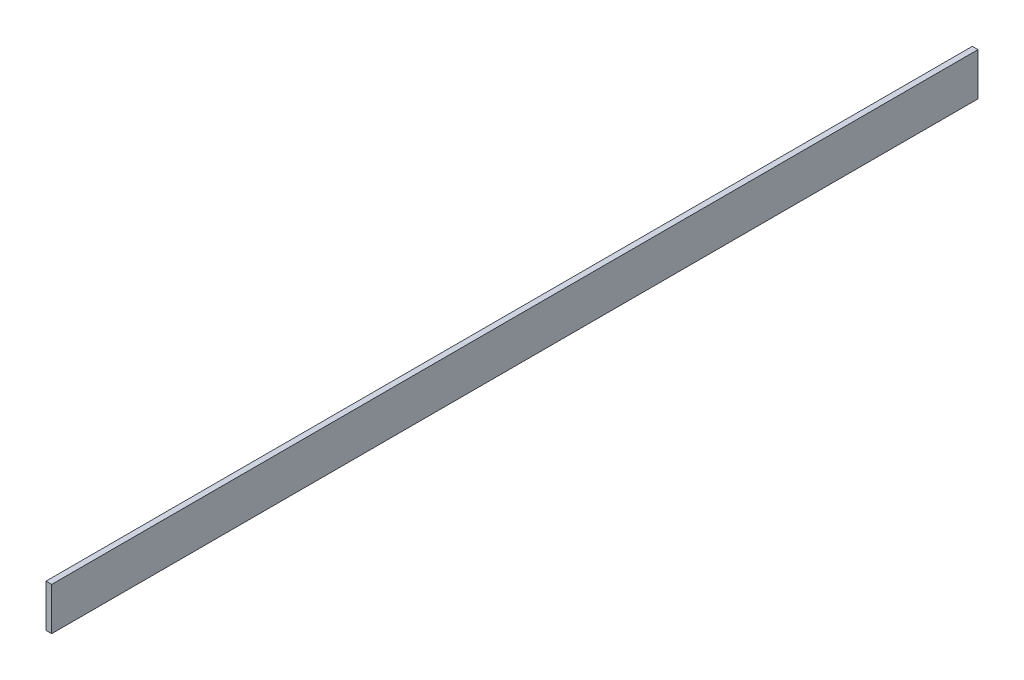
ISO-10303-21;
HEADER;
FILE_DESCRIPTION(('STEP AP214'),'2;1');
FILE_NAME('part.step','',(''),(''),'','','');
FILE_SCHEMA(('AUTOMOTIVE_DESIGN { 1 0 10303 214 1 1 1 1 }'));
ENDSEC;
DATA;
#1=APPLICATION_CONTEXT('core data for automotive mechanical design processes');
#2=APPLICATION_PROTOCOL_DEFINITION('international standard','automotive_design',2000,#1);
#3=PRODUCT_CONTEXT('',#1,'mechanical');
#4=PRODUCT('Part','Part','',(#3));
#5=PRODUCT_RELATED_PRODUCT_CATEGORY('part','',(#4));
#6=PRODUCT_DEFINITION_FORMATION('','',#4);
#7=PRODUCT_DEFINITION_CONTEXT('part definition',#1,'design');
#8=PRODUCT_DEFINITION('design','',#6,#7);
#9=PRODUCT_DEFINITION_SHAPE('','',#8);
#10=(LENGTH_UNIT() NAMED_UNIT(*) SI_UNIT(.MILLI.,.METRE.));
#11=(NAMED_UNIT(*) PLANE_ANGLE_UNIT() SI_UNIT($,.RADIAN.));
#12=(NAMED_UNIT(*) SI_UNIT($,.STERADIAN.) SOLID_ANGLE_UNIT());
#13=UNCERTAINTY_MEASURE_WITH_UNIT(LENGTH_MEASURE(1.E-05),#10,'distance_accuracy_value','');
#14=(GEOMETRIC_REPRESENTATION_CONTEXT(3) GLOBAL_UNCERTAINTY_ASSIGNED_CONTEXT((#13)) GLOBAL_UNIT_ASSIGNED_CONTEXT((#10,
#11,#12)) REPRESENTATION_CONTEXT('',''));
#15=CARTESIAN_POINT('',(0.,0.,0.));
#16=DIRECTION('',(0.,0.,1.));
#17=DIRECTION('',(1.,0.,0.));
#18=AXIS2_PLACEMENT_3D('',#15,#16,#17);
#19=CARTESIAN_POINT('',(-40.7498114749963,116.508082328953,-38.));
#20=DIRECTION('',(0.,-1.,0.));
#21=DIRECTION('',(1.,0.,0.));
#22=AXIS2_PLACEMENT_3D('',#19,#20,#21);
#23=PLANE('',#22);
#24=DIRECTION('',(0.,0.,-1.));
#25=VECTOR('',#24,1.);
#26=CARTESIAN_POINT('',(-36.7498114749963,116.508082328953,-38.));
#27=LINE('',#26,#25);
#28=CARTESIAN_POINT('',(-36.7498114749963,116.508082328953,613.));
#29=VERTEX_POINT('',#28);
#30=CARTESIAN_POINT('',(-36.7498114749963,116.508082328953,-38.));
#31=VERTEX_POINT('',#30);
#32=EDGE_CURVE('E97',#29,#31,#27,.T.);
#33=ORIENTED_EDGE('',*,*,#32,.T.);
#34=DIRECTION('',(1.,0.,0.));
#35=VECTOR('',#34,1.);
#36=CARTESIAN_POINT('',(-40.7498114749963,116.508082328953,-38.));
#37=LINE('',#36,#35);
#38=CARTESIAN_POINT('',(-40.7498114749963,116.508082328953,-38.));
#39=VERTEX_POINT('',#38);
#40=EDGE_CURVE('E11',#39,#31,#37,.T.);
#41=ORIENTED_EDGE('',*,*,#40,.F.);
#42=DIRECTION('',(0.,0.,-1.));
#43=VECTOR('',#42,1.);
#44=CARTESIAN_POINT('',(-40.7498114749963,116.508082328953,-38.));
#45=LINE('',#44,#43);
#46=CARTESIAN_POINT('',(-40.7498114749963,116.508082328953,613.));
#47=VERTEX_POINT('',#46);
#48=EDGE_CURVE('E85',#47,#39,#45,.T.);
#49=ORIENTED_EDGE('',*,*,#48,.F.);
#50=DIRECTION('',(1.,0.,0.));
#51=VECTOR('',#50,1.);
#52=CARTESIAN_POINT('',(-40.7498114749963,116.508082328953,613.));
#53=LINE('',#52,#51);
#54=EDGE_CURVE('E93',#47,#29,#53,.T.);
#55=ORIENTED_EDGE('',*,*,#54,.T.);
#56=EDGE_LOOP('',(#33,#41,#49,#55));
#57=FACE_BOUND('',#56,.T.);
#58=ADVANCED_FACE('F34',(#57),#23,.F.);
#59=CARTESIAN_POINT('',(-40.7498114749963,116.508082328953,-38.));
#60=DIRECTION('',(0.,0.,1.));
#61=DIRECTION('',(0.,-1.,0.));
#62=AXIS2_PLACEMENT_3D('',#59,#60,#61);
#63=PLANE('',#62);
#64=DIRECTION('',(0.,-1.,0.));
#65=VECTOR('',#64,1.);
#66=CARTESIAN_POINT('',(-36.7498114749963,116.508082328953,-38.));
#67=LINE('',#66,#65);
#68=CARTESIAN_POINT('',(-36.7498114749963,86.5080823289529,-38.));
#69=VERTEX_POINT('',#68);
#70=EDGE_CURVE('E89',#31,#69,#67,.T.);
#71=ORIENTED_EDGE('',*,*,#70,.T.);
#72=DIRECTION('',(1.,0.,0.));
#73=VECTOR('',#72,1.);
#74=CARTESIAN_POINT('',(-40.7498114749963,86.5080823289529,-38.));
#75=LINE('',#74,#73);
#76=CARTESIAN_POINT('',(-40.7498114749963,86.5080823289529,-38.));
#77=VERTEX_POINT('',#76);
#78=EDGE_CURVE('E42',#77,#69,#75,.T.);
#79=ORIENTED_EDGE('',*,*,#78,.F.);
#80=DIRECTION('',(0.,-1.,0.));
#81=VECTOR('',#80,1.);
#82=CARTESIAN_POINT('',(-40.7498114749963,116.508082328953,-38.));
#83=LINE('',#82,#81);
#84=EDGE_CURVE('E80',#39,#77,#83,.T.);
#85=ORIENTED_EDGE('',*,*,#84,.F.);
#86=ORIENTED_EDGE('',*,*,#40,.T.);
#87=EDGE_LOOP('',(#71,#79,#85,#86));
#88=FACE_BOUND('',#87,.T.);
#89=ADVANCED_FACE('F88',(#88),#63,.F.);
#90=CARTESIAN_POINT('',(-40.7498114749963,86.5080823289529,-38.));
#91=DIRECTION('',(0.,1.,0.));
#92=DIRECTION('',(-1.,0.,0.));
#93=AXIS2_PLACEMENT_3D('',#90,#91,#92);
#94=PLANE('',#93);
#95=DIRECTION('',(0.,0.,1.));
#96=VECTOR('',#95,1.);
#97=CARTESIAN_POINT('',(-36.7498114749963,86.5080823289529,-38.));
#98=LINE('',#97,#96);
#99=CARTESIAN_POINT('',(-36.7498114749963,86.5080823289529,613.));
#100=VERTEX_POINT('',#99);
#101=EDGE_CURVE('E67',#69,#100,#98,.T.);
#102=ORIENTED_EDGE('',*,*,#101,.T.);
#103=DIRECTION('',(1.,0.,0.));
#104=VECTOR('',#103,1.);
#105=CARTESIAN_POINT('',(-40.7498114749963,86.5080823289529,613.));
#106=LINE('',#105,#104);
#107=CARTESIAN_POINT('',(-40.7498114749963,86.5080823289529,613.));
#108=VERTEX_POINT('',#107);
#109=EDGE_CURVE('E90',#108,#100,#106,.T.);
#110=ORIENTED_EDGE('',*,*,#109,.F.);
#111=DIRECTION('',(0.,0.,1.));
#112=VECTOR('',#111,1.);
#113=CARTESIAN_POINT('',(-40.7498114749963,86.5080823289529,-38.));
#114=LINE('',#113,#112);
#115=EDGE_CURVE('E83',#77,#108,#114,.T.);
#116=ORIENTED_EDGE('',*,*,#115,.F.);
#117=ORIENTED_EDGE('',*,*,#78,.T.);
#118=EDGE_LOOP('',(#102,#110,#116,#117));
#119=FACE_BOUND('',#118,.T.);
#120=ADVANCED_FACE('F91',(#119),#94,.F.);
#121=CARTESIAN_POINT('',(-40.7498114749963,116.508082328953,613.));
#122=DIRECTION('',(0.,0.,-1.));
#123=DIRECTION('',(-1.,0.,0.));
#124=AXIS2_PLACEMENT_3D('',#121,#122,#123);
#125=PLANE('',#124);
#126=DIRECTION('',(0.,1.,0.));
#127=VECTOR('',#126,1.);
#128=CARTESIAN_POINT('',(-36.7498114749963,116.508082328953,613.));
#129=LINE('',#128,#127);
#130=EDGE_CURVE('E73',#100,#29,#129,.T.);
#131=ORIENTED_EDGE('',*,*,#130,.T.);
#132=ORIENTED_EDGE('',*,*,#54,.F.);
#133=DIRECTION('',(0.,1.,0.));
#134=VECTOR('',#133,1.);
#135=CARTESIAN_POINT('',(-40.7498114749963,116.508082328953,613.));
#136=LINE('',#135,#134);
#137=EDGE_CURVE('E50',#108,#47,#136,.T.);
#138=ORIENTED_EDGE('',*,*,#137,.F.);
#139=ORIENTED_EDGE('',*,*,#109,.T.);
#140=EDGE_LOOP('',(#131,#132,#138,#139));
#141=FACE_BOUND('',#140,.T.);
#142=ADVANCED_FACE('F104',(#141),#125,.F.);
#143=CARTESIAN_POINT('',(-40.7498114749963,0.,0.));
#144=DIRECTION('',(1.,0.,0.));
#145=DIRECTION('',(0.,1.,0.));
#146=AXIS2_PLACEMENT_3D('',#143,#144,#145);
#147=PLANE('',#146);
#148=ORIENTED_EDGE('',*,*,#48,.T.);
#149=ORIENTED_EDGE('',*,*,#84,.T.);
#150=ORIENTED_EDGE('',*,*,#115,.T.);
#151=ORIENTED_EDGE('',*,*,#137,.T.);
#152=EDGE_LOOP('',(#148,#149,#150,#151));
#153=FACE_BOUND('',#152,.T.);
#154=ADVANCED_FACE('F81',(#153),#147,.F.);
#155=CARTESIAN_POINT('',(-36.7498114749963,0.,0.));
#156=DIRECTION('',(1.,0.,0.));
#157=DIRECTION('',(0.,1.,0.));
#158=AXIS2_PLACEMENT_3D('',#155,#156,#157);
#159=PLANE('',#158);
#160=ORIENTED_EDGE('',*,*,#32,.F.);
#161=ORIENTED_EDGE('',*,*,#130,.F.);
#162=ORIENTED_EDGE('',*,*,#101,.F.);
#163=ORIENTED_EDGE('',*,*,#70,.F.);
#164=EDGE_LOOP('',(#160,#161,#162,#163));
#165=FACE_BOUND('',#164,.T.);
#166=ADVANCED_FACE('F107',(#165),#159,.T.);
#167=CLOSED_SHELL('',(#58,#89,#120,#142,#154,#166));
#168=MANIFOLD_SOLID_BREP('B2',#167);
#169=ADVANCED_BREP_SHAPE_REPRESENTATION('',(#18,#168),#14);
#170=SHAPE_DEFINITION_REPRESENTATION(#9,#169);
ENDSEC;
END-ISO-10303-21;
